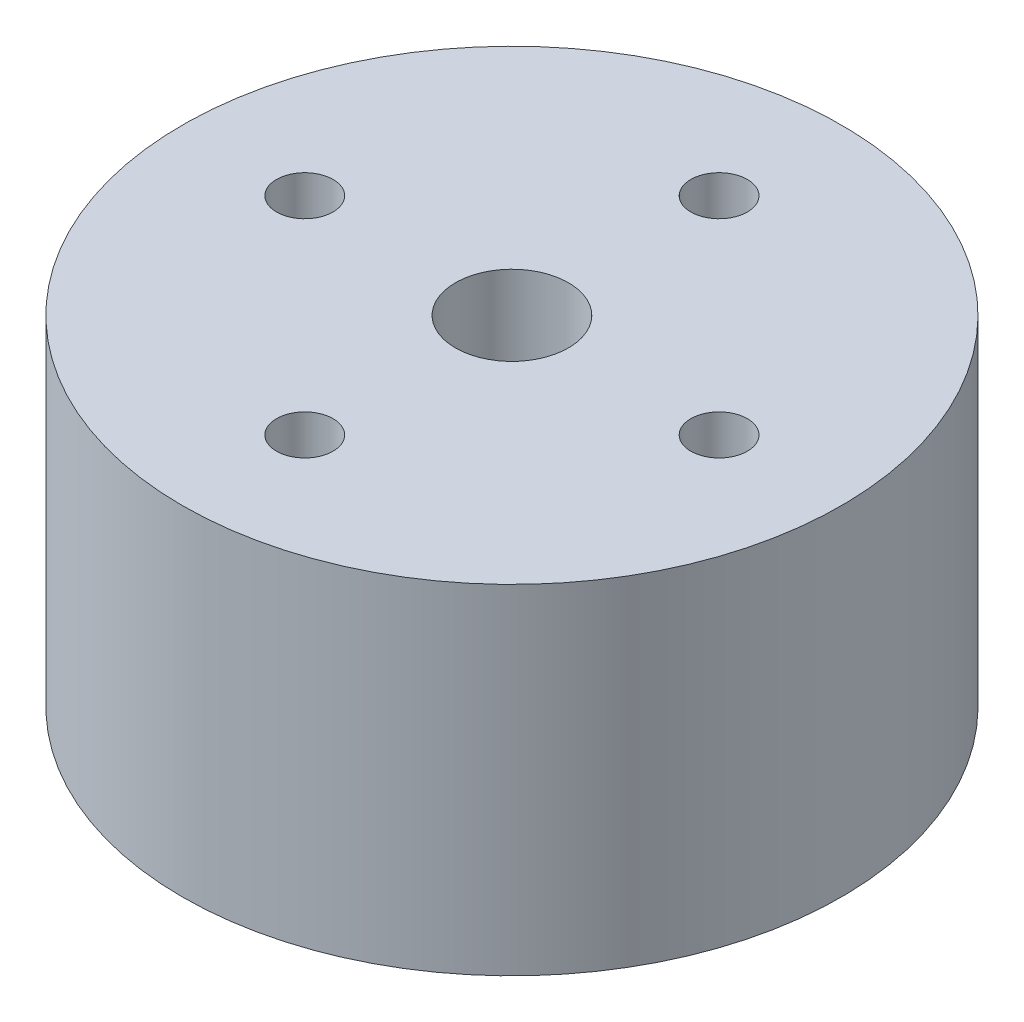
ISO-10303-21;
HEADER;
FILE_DESCRIPTION(('STEP AP214'),'2;1');
FILE_NAME('part.step','',(''),(''),'','','');
FILE_SCHEMA(('AUTOMOTIVE_DESIGN { 1 0 10303 214 1 1 1 1 }'));
ENDSEC;
DATA;
#1=APPLICATION_CONTEXT('core data for automotive mechanical design processes');
#2=APPLICATION_PROTOCOL_DEFINITION('international standard','automotive_design',2000,#1);
#3=PRODUCT_CONTEXT('',#1,'mechanical');
#4=PRODUCT('Part','Part','',(#3));
#5=PRODUCT_RELATED_PRODUCT_CATEGORY('part','',(#4));
#6=PRODUCT_DEFINITION_FORMATION('','',#4);
#7=PRODUCT_DEFINITION_CONTEXT('part definition',#1,'design');
#8=PRODUCT_DEFINITION('design','',#6,#7);
#9=PRODUCT_DEFINITION_SHAPE('','',#8);
#10=(LENGTH_UNIT() NAMED_UNIT(*) SI_UNIT(.MILLI.,.METRE.));
#11=(NAMED_UNIT(*) PLANE_ANGLE_UNIT() SI_UNIT($,.RADIAN.));
#12=(NAMED_UNIT(*) SI_UNIT($,.STERADIAN.) SOLID_ANGLE_UNIT());
#13=UNCERTAINTY_MEASURE_WITH_UNIT(LENGTH_MEASURE(1.E-05),#10,'distance_accuracy_value','');
#14=(GEOMETRIC_REPRESENTATION_CONTEXT(3) GLOBAL_UNCERTAINTY_ASSIGNED_CONTEXT((#13)) GLOBAL_UNIT_ASSIGNED_CONTEXT((#10,
#11,#12)) REPRESENTATION_CONTEXT('',''));
#15=CARTESIAN_POINT('',(0.,0.,0.));
#16=DIRECTION('',(0.,0.,1.));
#17=DIRECTION('',(1.,0.,0.));
#18=AXIS2_PLACEMENT_3D('',#15,#16,#17);
#19=CARTESIAN_POINT('',(0.,18.,0.));
#20=DIRECTION('',(0.,1.,0.));
#21=DIRECTION('',(0.,0.,1.));
#22=AXIS2_PLACEMENT_3D('',#19,#20,#21);
#23=PLANE('',#22);
#24=CARTESIAN_POINT('',(11.,18.,0.));
#25=DIRECTION('',(0.,1.,0.));
#26=DIRECTION('',(0.,0.,-1.));
#27=AXIS2_PLACEMENT_3D('',#24,#25,#26);
#28=CIRCLE('',#27,1.5);
#29=CARTESIAN_POINT('',(11.,18.,-1.50000000000004));
#30=VERTEX_POINT('',#29);
#31=EDGE_CURVE('E58',#30,#30,#28,.T.);
#32=ORIENTED_EDGE('',*,*,#31,.F.);
#33=EDGE_LOOP('',(#32));
#34=FACE_BOUND('',#33,.T.);
#35=CARTESIAN_POINT('',(0.,18.,-11.));
#36=DIRECTION('',(0.,1.,0.));
#37=DIRECTION('',(0.,0.,1.));
#38=AXIS2_PLACEMENT_3D('',#35,#36,#37);
#39=CIRCLE('',#38,1.5);
#40=CARTESIAN_POINT('',(0.,18.,-9.5));
#41=VERTEX_POINT('',#40);
#42=EDGE_CURVE('E46',#41,#41,#39,.T.);
#43=ORIENTED_EDGE('',*,*,#42,.F.);
#44=EDGE_LOOP('',(#43));
#45=FACE_BOUND('',#44,.T.);
#46=CARTESIAN_POINT('',(0.,18.,0.));
#47=DIRECTION('',(0.,1.,0.));
#48=DIRECTION('',(0.,0.,1.));
#49=AXIS2_PLACEMENT_3D('',#46,#47,#48);
#50=CIRCLE('',#49,17.5);
#51=CARTESIAN_POINT('',(0.,18.,17.5));
#52=VERTEX_POINT('',#51);
#53=EDGE_CURVE('E10',#52,#52,#50,.T.);
#54=ORIENTED_EDGE('',*,*,#53,.T.);
#55=EDGE_LOOP('',(#54));
#56=FACE_BOUND('',#55,.T.);
#57=CARTESIAN_POINT('',(0.,18.,0.));
#58=DIRECTION('',(0.,1.,0.));
#59=DIRECTION('',(0.,0.,1.));
#60=AXIS2_PLACEMENT_3D('',#57,#58,#59);
#61=CIRCLE('',#60,3.);
#62=CARTESIAN_POINT('',(0.,18.,3.));
#63=VERTEX_POINT('',#62);
#64=EDGE_CURVE('E41',#63,#63,#61,.T.);
#65=ORIENTED_EDGE('',*,*,#64,.F.);
#66=EDGE_LOOP('',(#65));
#67=FACE_BOUND('',#66,.T.);
#68=CARTESIAN_POINT('',(0.,18.,11.));
#69=DIRECTION('',(0.,1.,0.));
#70=DIRECTION('',(0.,0.,-1.));
#71=AXIS2_PLACEMENT_3D('',#68,#69,#70);
#72=CIRCLE('',#71,1.5);
#73=CARTESIAN_POINT('',(0.,18.,9.5));
#74=VERTEX_POINT('',#73);
#75=EDGE_CURVE('E52',#74,#74,#72,.T.);
#76=ORIENTED_EDGE('',*,*,#75,.F.);
#77=EDGE_LOOP('',(#76));
#78=FACE_BOUND('',#77,.T.);
#79=CARTESIAN_POINT('',(-11.,18.,0.));
#80=DIRECTION('',(0.,1.,0.));
#81=DIRECTION('',(0.,0.,1.));
#82=AXIS2_PLACEMENT_3D('',#79,#80,#81);
#83=CIRCLE('',#82,1.5);
#84=CARTESIAN_POINT('',(-11.,18.,1.50000000000004));
#85=VERTEX_POINT('',#84);
#86=EDGE_CURVE('E64',#85,#85,#83,.T.);
#87=ORIENTED_EDGE('',*,*,#86,.F.);
#88=EDGE_LOOP('',(#87));
#89=FACE_BOUND('',#88,.T.);
#90=ADVANCED_FACE('F30',(#34,#45,#56,#67,#78,#89),#23,.T.);
#91=CARTESIAN_POINT('',(0.,0.,0.));
#92=DIRECTION('',(0.,1.,0.));
#93=DIRECTION('',(0.,0.,1.));
#94=AXIS2_PLACEMENT_3D('',#91,#92,#93);
#95=PLANE('',#94);
#96=CARTESIAN_POINT('',(11.,0.,0.));
#97=DIRECTION('',(0.,1.,0.));
#98=DIRECTION('',(0.,0.,-1.));
#99=AXIS2_PLACEMENT_3D('',#96,#97,#98);
#100=CIRCLE('',#99,1.5);
#101=CARTESIAN_POINT('',(11.,0.,-1.50000000000004));
#102=VERTEX_POINT('',#101);
#103=EDGE_CURVE('E61',#102,#102,#100,.T.);
#104=ORIENTED_EDGE('',*,*,#103,.T.);
#105=EDGE_LOOP('',(#104));
#106=FACE_BOUND('',#105,.T.);
#107=CARTESIAN_POINT('',(0.,0.,-11.));
#108=DIRECTION('',(0.,1.,0.));
#109=DIRECTION('',(0.,0.,1.));
#110=AXIS2_PLACEMENT_3D('',#107,#108,#109);
#111=CIRCLE('',#110,1.5);
#112=CARTESIAN_POINT('',(0.,0.,-9.5));
#113=VERTEX_POINT('',#112);
#114=EDGE_CURVE('E49',#113,#113,#111,.T.);
#115=ORIENTED_EDGE('',*,*,#114,.T.);
#116=EDGE_LOOP('',(#115));
#117=FACE_BOUND('',#116,.T.);
#118=CARTESIAN_POINT('',(0.,0.,0.));
#119=DIRECTION('',(0.,1.,0.));
#120=DIRECTION('',(0.,0.,1.));
#121=AXIS2_PLACEMENT_3D('',#118,#119,#120);
#122=CIRCLE('',#121,17.5);
#123=CARTESIAN_POINT('',(0.,0.,17.5));
#124=VERTEX_POINT('',#123);
#125=EDGE_CURVE('E34',#124,#124,#122,.T.);
#126=ORIENTED_EDGE('',*,*,#125,.F.);
#127=EDGE_LOOP('',(#126));
#128=FACE_BOUND('',#127,.T.);
#129=CARTESIAN_POINT('',(0.,0.,0.));
#130=DIRECTION('',(0.,1.,0.));
#131=DIRECTION('',(0.,0.,1.));
#132=AXIS2_PLACEMENT_3D('',#129,#130,#131);
#133=CIRCLE('',#132,3.);
#134=CARTESIAN_POINT('',(0.,0.,3.));
#135=VERTEX_POINT('',#134);
#136=EDGE_CURVE('E43',#135,#135,#133,.T.);
#137=ORIENTED_EDGE('',*,*,#136,.T.);
#138=EDGE_LOOP('',(#137));
#139=FACE_BOUND('',#138,.T.);
#140=CARTESIAN_POINT('',(0.,0.,11.));
#141=DIRECTION('',(0.,1.,0.));
#142=DIRECTION('',(0.,0.,-1.));
#143=AXIS2_PLACEMENT_3D('',#140,#141,#142);
#144=CIRCLE('',#143,1.5);
#145=CARTESIAN_POINT('',(0.,0.,9.5));
#146=VERTEX_POINT('',#145);
#147=EDGE_CURVE('E55',#146,#146,#144,.T.);
#148=ORIENTED_EDGE('',*,*,#147,.T.);
#149=EDGE_LOOP('',(#148));
#150=FACE_BOUND('',#149,.T.);
#151=CARTESIAN_POINT('',(-11.,0.,0.));
#152=DIRECTION('',(0.,1.,0.));
#153=DIRECTION('',(0.,0.,1.));
#154=AXIS2_PLACEMENT_3D('',#151,#152,#153);
#155=CIRCLE('',#154,1.5);
#156=CARTESIAN_POINT('',(-11.,0.,1.50000000000004));
#157=VERTEX_POINT('',#156);
#158=EDGE_CURVE('E67',#157,#157,#155,.T.);
#159=ORIENTED_EDGE('',*,*,#158,.T.);
#160=EDGE_LOOP('',(#159));
#161=FACE_BOUND('',#160,.T.);
#162=ADVANCED_FACE('F77',(#106,#117,#128,#139,#150,#161),#95,.F.);
#163=CARTESIAN_POINT('',(0.,18.,0.));
#164=DIRECTION('',(0.,-1.,0.));
#165=DIRECTION('',(0.,0.,-1.));
#166=AXIS2_PLACEMENT_3D('',#163,#164,#165);
#167=CYLINDRICAL_SURFACE('',#166,17.5);
#168=ORIENTED_EDGE('',*,*,#53,.F.);
#169=EDGE_LOOP('',(#168));
#170=FACE_BOUND('',#169,.T.);
#171=ORIENTED_EDGE('',*,*,#125,.T.);
#172=EDGE_LOOP('',(#171));
#173=FACE_BOUND('',#172,.T.);
#174=ADVANCED_FACE('F32',(#170,#173),#167,.T.);
#175=CARTESIAN_POINT('',(0.,18.,0.));
#176=DIRECTION('',(0.,-1.,0.));
#177=DIRECTION('',(0.,0.,-1.));
#178=AXIS2_PLACEMENT_3D('',#175,#176,#177);
#179=CYLINDRICAL_SURFACE('',#178,3.);
#180=ORIENTED_EDGE('',*,*,#64,.T.);
#181=EDGE_LOOP('',(#180));
#182=FACE_BOUND('',#181,.T.);
#183=ORIENTED_EDGE('',*,*,#136,.F.);
#184=EDGE_LOOP('',(#183));
#185=FACE_BOUND('',#184,.T.);
#186=ADVANCED_FACE('F87',(#182,#185),#179,.F.);
#187=CARTESIAN_POINT('',(0.,18.,-11.));
#188=DIRECTION('',(0.,-1.,0.));
#189=DIRECTION('',(0.,0.,-1.));
#190=AXIS2_PLACEMENT_3D('',#187,#188,#189);
#191=CYLINDRICAL_SURFACE('',#190,1.5);
#192=ORIENTED_EDGE('',*,*,#42,.T.);
#193=EDGE_LOOP('',(#192));
#194=FACE_BOUND('',#193,.T.);
#195=ORIENTED_EDGE('',*,*,#114,.F.);
#196=EDGE_LOOP('',(#195));
#197=FACE_BOUND('',#196,.T.);
#198=ADVANCED_FACE('F90',(#194,#197),#191,.F.);
#199=CARTESIAN_POINT('',(0.,18.,11.));
#200=DIRECTION('',(0.,-1.,0.));
#201=DIRECTION('',(0.,0.,-1.));
#202=AXIS2_PLACEMENT_3D('',#199,#200,#201);
#203=CYLINDRICAL_SURFACE('',#202,1.5);
#204=ORIENTED_EDGE('',*,*,#75,.T.);
#205=EDGE_LOOP('',(#204));
#206=FACE_BOUND('',#205,.T.);
#207=ORIENTED_EDGE('',*,*,#147,.F.);
#208=EDGE_LOOP('',(#207));
#209=FACE_BOUND('',#208,.T.);
#210=ADVANCED_FACE('F94',(#206,#209),#203,.F.);
#211=CARTESIAN_POINT('',(11.,18.,0.));
#212=DIRECTION('',(0.,-1.,0.));
#213=DIRECTION('',(0.,0.,-1.));
#214=AXIS2_PLACEMENT_3D('',#211,#212,#213);
#215=CYLINDRICAL_SURFACE('',#214,1.5);
#216=ORIENTED_EDGE('',*,*,#31,.T.);
#217=EDGE_LOOP('',(#216));
#218=FACE_BOUND('',#217,.T.);
#219=ORIENTED_EDGE('',*,*,#103,.F.);
#220=EDGE_LOOP('',(#219));
#221=FACE_BOUND('',#220,.T.);
#222=ADVANCED_FACE('F98',(#218,#221),#215,.F.);
#223=CARTESIAN_POINT('',(-11.,18.,0.));
#224=DIRECTION('',(0.,-1.,0.));
#225=DIRECTION('',(0.,0.,-1.));
#226=AXIS2_PLACEMENT_3D('',#223,#224,#225);
#227=CYLINDRICAL_SURFACE('',#226,1.5);
#228=ORIENTED_EDGE('',*,*,#86,.T.);
#229=EDGE_LOOP('',(#228));
#230=FACE_BOUND('',#229,.T.);
#231=ORIENTED_EDGE('',*,*,#158,.F.);
#232=EDGE_LOOP('',(#231));
#233=FACE_BOUND('',#232,.T.);
#234=ADVANCED_FACE('F73',(#230,#233),#227,.F.);
#235=CLOSED_SHELL('',(#90,#162,#174,#186,#198,#210,#222,#234));
#236=MANIFOLD_SOLID_BREP('B2',#235);
#237=ADVANCED_BREP_SHAPE_REPRESENTATION('',(#18,#236),#14);
#238=SHAPE_DEFINITION_REPRESENTATION(#9,#237);
ENDSEC;
END-ISO-10303-21;
